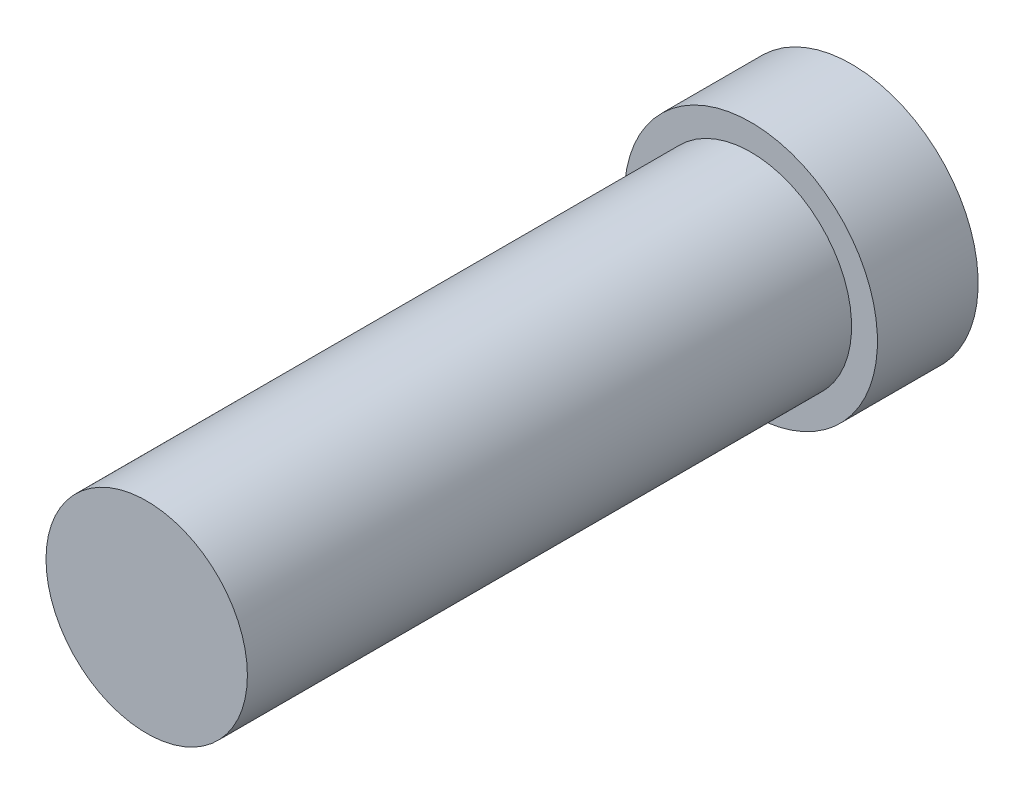
ISO-10303-21;
HEADER;
FILE_DESCRIPTION(('STEP AP214'),'2;1');
FILE_NAME('part.step','',(''),(''),'','','');
FILE_SCHEMA(('AUTOMOTIVE_DESIGN { 1 0 10303 214 1 1 1 1 }'));
ENDSEC;
DATA;
#1=APPLICATION_CONTEXT('core data for automotive mechanical design processes');
#2=APPLICATION_PROTOCOL_DEFINITION('international standard','automotive_design',2000,#1);
#3=PRODUCT_CONTEXT('',#1,'mechanical');
#4=PRODUCT('Part','Part','',(#3));
#5=PRODUCT_RELATED_PRODUCT_CATEGORY('part','',(#4));
#6=PRODUCT_DEFINITION_FORMATION('','',#4);
#7=PRODUCT_DEFINITION_CONTEXT('part definition',#1,'design');
#8=PRODUCT_DEFINITION('design','',#6,#7);
#9=PRODUCT_DEFINITION_SHAPE('','',#8);
#10=(LENGTH_UNIT() NAMED_UNIT(*) SI_UNIT(.MILLI.,.METRE.));
#11=(NAMED_UNIT(*) PLANE_ANGLE_UNIT() SI_UNIT($,.RADIAN.));
#12=(NAMED_UNIT(*) SI_UNIT($,.STERADIAN.) SOLID_ANGLE_UNIT());
#13=UNCERTAINTY_MEASURE_WITH_UNIT(LENGTH_MEASURE(1.E-05),#10,'distance_accuracy_value','');
#14=(GEOMETRIC_REPRESENTATION_CONTEXT(3) GLOBAL_UNCERTAINTY_ASSIGNED_CONTEXT((#13)) GLOBAL_UNIT_ASSIGNED_CONTEXT((#10,
#11,#12)) REPRESENTATION_CONTEXT('',''));
#15=CARTESIAN_POINT('',(0.,0.,0.));
#16=DIRECTION('',(0.,0.,1.));
#17=DIRECTION('',(1.,0.,0.));
#18=AXIS2_PLACEMENT_3D('',#15,#16,#17);
#19=CARTESIAN_POINT('',(0.,0.,20.));
#20=DIRECTION('',(0.,0.,-1.));
#21=DIRECTION('',(-1.,0.,0.));
#22=AXIS2_PLACEMENT_3D('',#19,#20,#21);
#23=CYLINDRICAL_SURFACE('',#22,3.);
#24=CARTESIAN_POINT('',(0.,0.,20.));
#25=DIRECTION('',(0.,0.,1.));
#26=DIRECTION('',(1.,0.,0.));
#27=AXIS2_PLACEMENT_3D('',#24,#25,#26);
#28=CIRCLE('',#27,3.);
#29=CARTESIAN_POINT('',(3.,0.,20.));
#30=VERTEX_POINT('',#29);
#31=EDGE_CURVE('E51',#30,#30,#28,.T.);
#32=ORIENTED_EDGE('',*,*,#31,.F.);
#33=EDGE_LOOP('',(#32));
#34=FACE_BOUND('',#33,.T.);
#35=CARTESIAN_POINT('',(0.,0.,2.));
#36=DIRECTION('',(0.,0.,-1.));
#37=DIRECTION('',(-1.,0.,0.));
#38=AXIS2_PLACEMENT_3D('',#35,#36,#37);
#39=CIRCLE('',#38,3.);
#40=CARTESIAN_POINT('',(-3.,0.,2.));
#41=VERTEX_POINT('',#40);
#42=EDGE_CURVE('E11',#41,#41,#39,.T.);
#43=ORIENTED_EDGE('',*,*,#42,.F.);
#44=EDGE_LOOP('',(#43));
#45=FACE_BOUND('',#44,.T.);
#46=ADVANCED_FACE('F45',(#34,#45),#23,.T.);
#47=CARTESIAN_POINT('',(0.,0.,20.));
#48=DIRECTION('',(0.,0.,1.));
#49=DIRECTION('',(1.,0.,0.));
#50=AXIS2_PLACEMENT_3D('',#47,#48,#49);
#51=PLANE('',#50);
#52=ORIENTED_EDGE('',*,*,#31,.T.);
#53=EDGE_LOOP('',(#52));
#54=FACE_BOUND('',#53,.T.);
#55=ADVANCED_FACE('F87',(#54),#51,.T.);
#56=CARTESIAN_POINT('',(0.,0.,-1.));
#57=DIRECTION('',(0.,0.,1.));
#58=DIRECTION('',(1.,0.,0.));
#59=AXIS2_PLACEMENT_3D('',#56,#57,#58);
#60=CYLINDRICAL_SURFACE('',#59,2.77010798553374);
#61=CARTESIAN_POINT('',(0.,0.,-1.));
#62=DIRECTION('',(0.,0.,-1.));
#63=DIRECTION('',(-1.,0.,0.));
#64=AXIS2_PLACEMENT_3D('',#61,#62,#63);
#65=CIRCLE('',#64,2.77010798553374);
#66=CARTESIAN_POINT('',(-2.77010798553374,0.,-1.));
#67=VERTEX_POINT('',#66);
#68=EDGE_CURVE('E64',#67,#67,#65,.T.);
#69=ORIENTED_EDGE('',*,*,#68,.T.);
#70=EDGE_LOOP('',(#69));
#71=FACE_BOUND('',#70,.T.);
#72=CARTESIAN_POINT('',(0.,0.,0.));
#73=DIRECTION('',(0.,0.,1.));
#74=DIRECTION('',(1.,0.,0.));
#75=AXIS2_PLACEMENT_3D('',#72,#73,#74);
#76=CIRCLE('',#75,2.77010798553374);
#77=CARTESIAN_POINT('',(2.77010798553374,0.,0.));
#78=VERTEX_POINT('',#77);
#79=EDGE_CURVE('E55',#78,#78,#76,.F.);
#80=ORIENTED_EDGE('',*,*,#79,.F.);
#81=EDGE_LOOP('',(#80));
#82=FACE_BOUND('',#81,.T.);
#83=ADVANCED_FACE('F92',(#71,#82),#60,.F.);
#84=CARTESIAN_POINT('',(0.,0.,-1.));
#85=DIRECTION('',(0.,0.,-1.));
#86=DIRECTION('',(-1.,0.,0.));
#87=AXIS2_PLACEMENT_3D('',#84,#85,#86);
#88=PLANE('',#87);
#89=CARTESIAN_POINT('',(0.,0.,-1.));
#90=DIRECTION('',(0.,0.,-1.));
#91=DIRECTION('',(-1.,0.,0.));
#92=AXIS2_PLACEMENT_3D('',#89,#90,#91);
#93=CIRCLE('',#92,3.77010798553374);
#94=CARTESIAN_POINT('',(-3.77010798553374,0.,-1.));
#95=VERTEX_POINT('',#94);
#96=EDGE_CURVE('E60',#95,#95,#93,.T.);
#97=ORIENTED_EDGE('',*,*,#96,.T.);
#98=EDGE_LOOP('',(#97));
#99=FACE_BOUND('',#98,.T.);
#100=ORIENTED_EDGE('',*,*,#68,.F.);
#101=EDGE_LOOP('',(#100));
#102=FACE_BOUND('',#101,.T.);
#103=ADVANCED_FACE('F82',(#99,#102),#88,.T.);
#104=CARTESIAN_POINT('',(0.,0.,-1.));
#105=DIRECTION('',(0.,0.,1.));
#106=DIRECTION('',(1.,0.,0.));
#107=AXIS2_PLACEMENT_3D('',#104,#105,#106);
#108=CYLINDRICAL_SURFACE('',#107,3.77010798553374);
#109=ORIENTED_EDGE('',*,*,#96,.F.);
#110=EDGE_LOOP('',(#109));
#111=FACE_BOUND('',#110,.T.);
#112=CARTESIAN_POINT('',(0.,0.,2.));
#113=DIRECTION('',(0.,0.,-1.));
#114=DIRECTION('',(-1.,0.,0.));
#115=AXIS2_PLACEMENT_3D('',#112,#113,#114);
#116=CIRCLE('',#115,3.77010798553374);
#117=CARTESIAN_POINT('',(-3.77010798553374,0.,2.));
#118=VERTEX_POINT('',#117);
#119=EDGE_CURVE('E67',#118,#118,#116,.T.);
#120=ORIENTED_EDGE('',*,*,#119,.T.);
#121=EDGE_LOOP('',(#120));
#122=FACE_BOUND('',#121,.T.);
#123=ADVANCED_FACE('F71',(#111,#122),#108,.T.);
#124=CARTESIAN_POINT('',(0.,0.,2.));
#125=DIRECTION('',(0.,0.,-1.));
#126=DIRECTION('',(-1.,0.,0.));
#127=AXIS2_PLACEMENT_3D('',#124,#125,#126);
#128=PLANE('',#127);
#129=ORIENTED_EDGE('',*,*,#42,.T.);
#130=EDGE_LOOP('',(#129));
#131=FACE_BOUND('',#130,.T.);
#132=ORIENTED_EDGE('',*,*,#119,.F.);
#133=EDGE_LOOP('',(#132));
#134=FACE_BOUND('',#133,.T.);
#135=ADVANCED_FACE('F73',(#131,#134),#128,.F.);
#136=CARTESIAN_POINT('',(0.,0.,0.));
#137=DIRECTION('',(0.,0.,1.));
#138=DIRECTION('',(1.,0.,0.));
#139=AXIS2_PLACEMENT_3D('',#136,#137,#138);
#140=PLANE('',#139);
#141=ORIENTED_EDGE('',*,*,#79,.T.);
#142=EDGE_LOOP('',(#141));
#143=FACE_BOUND('',#142,.T.);
#144=ADVANCED_FACE('F75',(#143),#140,.F.);
#145=CLOSED_SHELL('',(#46,#55,#83,#103,#123,#135,#144));
#146=MANIFOLD_SOLID_BREP('B2',#145);
#147=ADVANCED_BREP_SHAPE_REPRESENTATION('',(#18,#146),#14);
#148=SHAPE_DEFINITION_REPRESENTATION(#9,#147);
ENDSEC;
END-ISO-10303-21;
